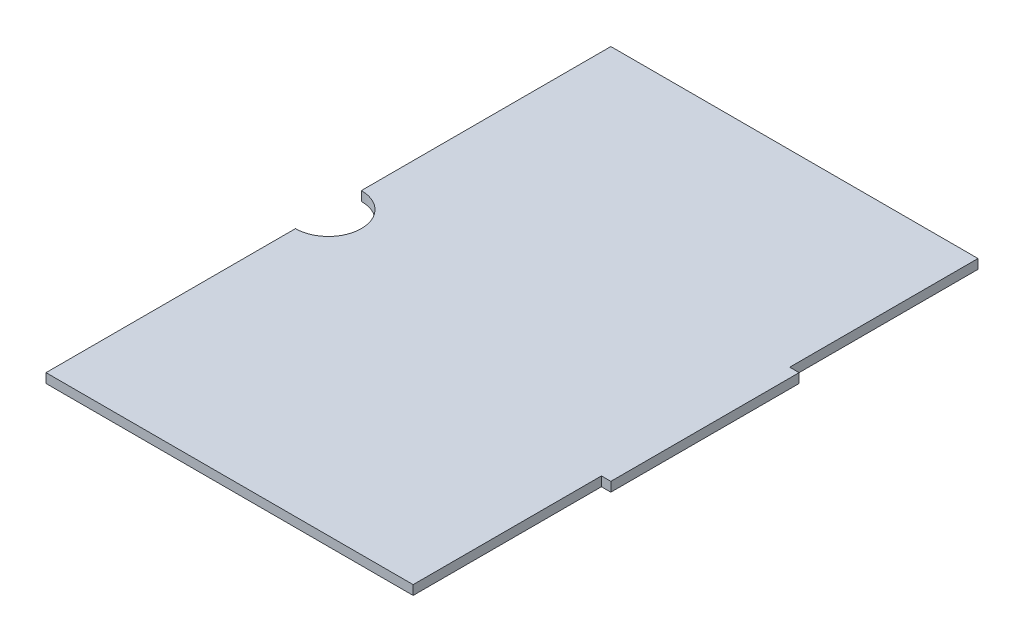
ISO-10303-21;
HEADER;
FILE_DESCRIPTION(('STEP AP214'),'2;1');
FILE_NAME('part.step','',(''),(''),'','','');
FILE_SCHEMA(('AUTOMOTIVE_DESIGN { 1 0 10303 214 1 1 1 1 }'));
ENDSEC;
DATA;
#1=APPLICATION_CONTEXT('core data for automotive mechanical design processes');
#2=APPLICATION_PROTOCOL_DEFINITION('international standard','automotive_design',2000,#1);
#3=PRODUCT_CONTEXT('',#1,'mechanical');
#4=PRODUCT('Part','Part','',(#3));
#5=PRODUCT_RELATED_PRODUCT_CATEGORY('part','',(#4));
#6=PRODUCT_DEFINITION_FORMATION('','',#4);
#7=PRODUCT_DEFINITION_CONTEXT('part definition',#1,'design');
#8=PRODUCT_DEFINITION('design','',#6,#7);
#9=PRODUCT_DEFINITION_SHAPE('','',#8);
#10=(LENGTH_UNIT() NAMED_UNIT(*) SI_UNIT(.MILLI.,.METRE.));
#11=(NAMED_UNIT(*) PLANE_ANGLE_UNIT() SI_UNIT($,.RADIAN.));
#12=(NAMED_UNIT(*) SI_UNIT($,.STERADIAN.) SOLID_ANGLE_UNIT());
#13=UNCERTAINTY_MEASURE_WITH_UNIT(LENGTH_MEASURE(1.E-05),#10,'distance_accuracy_value','');
#14=(GEOMETRIC_REPRESENTATION_CONTEXT(3) GLOBAL_UNCERTAINTY_ASSIGNED_CONTEXT((#13)) GLOBAL_UNIT_ASSIGNED_CONTEXT((#10,
#11,#12)) REPRESENTATION_CONTEXT('',''));
#15=CARTESIAN_POINT('',(0.,0.,0.));
#16=DIRECTION('',(0.,0.,1.));
#17=DIRECTION('',(1.,0.,0.));
#18=AXIS2_PLACEMENT_3D('',#15,#16,#17);
#19=CARTESIAN_POINT('',(-60.,3.,-90.));
#20=DIRECTION('',(1.,0.,0.));
#21=DIRECTION('',(0.,0.,-1.));
#22=AXIS2_PLACEMENT_3D('',#19,#20,#21);
#23=PLANE('',#22);
#24=DIRECTION('',(0.,0.,1.));
#25=VECTOR('',#24,1.);
#26=CARTESIAN_POINT('',(-60.,0.,-90.));
#27=LINE('',#26,#25);
#28=CARTESIAN_POINT('',(-60.,0.,-90.));
#29=VERTEX_POINT('',#28);
#30=CARTESIAN_POINT('',(-60.,0.,-10.5));
#31=VERTEX_POINT('',#30);
#32=EDGE_CURVE('E142',#29,#31,#27,.T.);
#33=ORIENTED_EDGE('',*,*,#32,.T.);
#34=DIRECTION('',(0.,-1.,0.));
#35=VECTOR('',#34,1.);
#36=CARTESIAN_POINT('',(-60.,3.,-10.5));
#37=LINE('',#36,#35);
#38=CARTESIAN_POINT('',(-60.,3.,-10.5));
#39=VERTEX_POINT('',#38);
#40=EDGE_CURVE('E11',#39,#31,#37,.T.);
#41=ORIENTED_EDGE('',*,*,#40,.F.);
#42=DIRECTION('',(0.,0.,1.));
#43=VECTOR('',#42,1.);
#44=CARTESIAN_POINT('',(-60.,3.,-90.));
#45=LINE('',#44,#43);
#46=CARTESIAN_POINT('',(-60.,3.,-90.));
#47=VERTEX_POINT('',#46);
#48=EDGE_CURVE('E160',#47,#39,#45,.T.);
#49=ORIENTED_EDGE('',*,*,#48,.F.);
#50=DIRECTION('',(0.,-1.,0.));
#51=VECTOR('',#50,1.);
#52=CARTESIAN_POINT('',(-60.,3.,-90.));
#53=LINE('',#52,#51);
#54=EDGE_CURVE('E138',#47,#29,#53,.T.);
#55=ORIENTED_EDGE('',*,*,#54,.T.);
#56=EDGE_LOOP('',(#33,#41,#49,#55));
#57=FACE_BOUND('',#56,.T.);
#58=ADVANCED_FACE('F34',(#57),#23,.F.);
#59=CARTESIAN_POINT('',(-60.,3.,0.));
#60=DIRECTION('',(0.,-1.,0.));
#61=DIRECTION('',(0.,0.,-1.));
#62=AXIS2_PLACEMENT_3D('',#59,#60,#61);
#63=CYLINDRICAL_SURFACE('',#62,10.5);
#64=CARTESIAN_POINT('',(-60.,0.,0.));
#65=DIRECTION('',(0.,-1.,0.));
#66=DIRECTION('',(0.,0.,1.));
#67=AXIS2_PLACEMENT_3D('',#64,#65,#66);
#68=CIRCLE('',#67,10.5);
#69=CARTESIAN_POINT('',(-60.,0.,10.5));
#70=VERTEX_POINT('',#69);
#71=EDGE_CURVE('E145',#31,#70,#68,.T.);
#72=ORIENTED_EDGE('',*,*,#71,.T.);
#73=DIRECTION('',(0.,-1.,0.));
#74=VECTOR('',#73,1.);
#75=CARTESIAN_POINT('',(-60.,3.,10.5));
#76=LINE('',#75,#74);
#77=CARTESIAN_POINT('',(-60.,3.,10.5));
#78=VERTEX_POINT('',#77);
#79=EDGE_CURVE('E42',#78,#70,#76,.T.);
#80=ORIENTED_EDGE('',*,*,#79,.F.);
#81=CARTESIAN_POINT('',(-60.,3.,0.));
#82=DIRECTION('',(0.,-1.,0.));
#83=DIRECTION('',(0.,0.,1.));
#84=AXIS2_PLACEMENT_3D('',#81,#82,#83);
#85=CIRCLE('',#84,10.5);
#86=EDGE_CURVE('E99',#39,#78,#85,.T.);
#87=ORIENTED_EDGE('',*,*,#86,.F.);
#88=ORIENTED_EDGE('',*,*,#40,.T.);
#89=EDGE_LOOP('',(#72,#80,#87,#88));
#90=FACE_BOUND('',#89,.T.);
#91=ADVANCED_FACE('F209',(#90),#63,.F.);
#92=CARTESIAN_POINT('',(-60.,3.,10.5));
#93=DIRECTION('',(1.,0.,0.));
#94=DIRECTION('',(0.,0.,-1.));
#95=AXIS2_PLACEMENT_3D('',#92,#93,#94);
#96=PLANE('',#95);
#97=DIRECTION('',(0.,0.,1.));
#98=VECTOR('',#97,1.);
#99=CARTESIAN_POINT('',(-60.,0.,10.5));
#100=LINE('',#99,#98);
#101=CARTESIAN_POINT('',(-60.,0.,90.));
#102=VERTEX_POINT('',#101);
#103=EDGE_CURVE('E147',#70,#102,#100,.T.);
#104=ORIENTED_EDGE('',*,*,#103,.T.);
#105=DIRECTION('',(0.,-1.,0.));
#106=VECTOR('',#105,1.);
#107=CARTESIAN_POINT('',(-60.,3.,90.));
#108=LINE('',#107,#106);
#109=CARTESIAN_POINT('',(-60.,3.,90.));
#110=VERTEX_POINT('',#109);
#111=EDGE_CURVE('E173',#110,#102,#108,.T.);
#112=ORIENTED_EDGE('',*,*,#111,.F.);
#113=DIRECTION('',(0.,0.,1.));
#114=VECTOR('',#113,1.);
#115=CARTESIAN_POINT('',(-60.,3.,10.5));
#116=LINE('',#115,#114);
#117=EDGE_CURVE('E181',#78,#110,#116,.T.);
#118=ORIENTED_EDGE('',*,*,#117,.F.);
#119=ORIENTED_EDGE('',*,*,#79,.T.);
#120=EDGE_LOOP('',(#104,#112,#118,#119));
#121=FACE_BOUND('',#120,.T.);
#122=ADVANCED_FACE('F179',(#121),#96,.F.);
#123=CARTESIAN_POINT('',(-60.,3.,90.));
#124=DIRECTION('',(0.,0.,-1.));
#125=DIRECTION('',(-1.,0.,0.));
#126=AXIS2_PLACEMENT_3D('',#123,#124,#125);
#127=PLANE('',#126);
#128=DIRECTION('',(1.,0.,0.));
#129=VECTOR('',#128,1.);
#130=CARTESIAN_POINT('',(-60.,0.,90.));
#131=LINE('',#130,#129);
#132=CARTESIAN_POINT('',(57.,0.,90.));
#133=VERTEX_POINT('',#132);
#134=EDGE_CURVE('E149',#102,#133,#131,.T.);
#135=ORIENTED_EDGE('',*,*,#134,.T.);
#136=DIRECTION('',(0.,-1.,0.));
#137=VECTOR('',#136,1.);
#138=CARTESIAN_POINT('',(57.,3.,90.));
#139=LINE('',#138,#137);
#140=CARTESIAN_POINT('',(57.,3.,90.));
#141=VERTEX_POINT('',#140);
#142=EDGE_CURVE('E170',#141,#133,#139,.T.);
#143=ORIENTED_EDGE('',*,*,#142,.F.);
#144=DIRECTION('',(1.,0.,0.));
#145=VECTOR('',#144,1.);
#146=CARTESIAN_POINT('',(-60.,3.,90.));
#147=LINE('',#146,#145);
#148=EDGE_CURVE('E199',#110,#141,#147,.T.);
#149=ORIENTED_EDGE('',*,*,#148,.F.);
#150=ORIENTED_EDGE('',*,*,#111,.T.);
#151=EDGE_LOOP('',(#135,#143,#149,#150));
#152=FACE_BOUND('',#151,.T.);
#153=ADVANCED_FACE('F190',(#152),#127,.F.);
#154=CARTESIAN_POINT('',(57.,3.,30.));
#155=DIRECTION('',(-1.,0.,0.));
#156=DIRECTION('',(0.,0.,1.));
#157=AXIS2_PLACEMENT_3D('',#154,#155,#156);
#158=PLANE('',#157);
#159=DIRECTION('',(0.,0.,-1.));
#160=VECTOR('',#159,1.);
#161=CARTESIAN_POINT('',(57.,0.,30.));
#162=LINE('',#161,#160);
#163=CARTESIAN_POINT('',(57.,0.,30.));
#164=VERTEX_POINT('',#163);
#165=EDGE_CURVE('E151',#133,#164,#162,.T.);
#166=ORIENTED_EDGE('',*,*,#165,.T.);
#167=DIRECTION('',(0.,-1.,0.));
#168=VECTOR('',#167,1.);
#169=CARTESIAN_POINT('',(57.,3.,30.));
#170=LINE('',#169,#168);
#171=CARTESIAN_POINT('',(57.,3.,30.));
#172=VERTEX_POINT('',#171);
#173=EDGE_CURVE('E167',#172,#164,#170,.T.);
#174=ORIENTED_EDGE('',*,*,#173,.F.);
#175=DIRECTION('',(0.,0.,-1.));
#176=VECTOR('',#175,1.);
#177=CARTESIAN_POINT('',(57.,3.,30.));
#178=LINE('',#177,#176);
#179=EDGE_CURVE('E196',#141,#172,#178,.T.);
#180=ORIENTED_EDGE('',*,*,#179,.F.);
#181=ORIENTED_EDGE('',*,*,#142,.T.);
#182=EDGE_LOOP('',(#166,#174,#180,#181));
#183=FACE_BOUND('',#182,.T.);
#184=ADVANCED_FACE('F194',(#183),#158,.F.);
#185=CARTESIAN_POINT('',(57.,3.,30.));
#186=DIRECTION('',(0.,0.,-1.));
#187=DIRECTION('',(-1.,0.,0.));
#188=AXIS2_PLACEMENT_3D('',#185,#186,#187);
#189=PLANE('',#188);
#190=DIRECTION('',(1.,0.,0.));
#191=VECTOR('',#190,1.);
#192=CARTESIAN_POINT('',(57.,0.,30.));
#193=LINE('',#192,#191);
#194=CARTESIAN_POINT('',(60.,0.,30.));
#195=VERTEX_POINT('',#194);
#196=EDGE_CURVE('E153',#164,#195,#193,.T.);
#197=ORIENTED_EDGE('',*,*,#196,.T.);
#198=DIRECTION('',(0.,-1.,0.));
#199=VECTOR('',#198,1.);
#200=CARTESIAN_POINT('',(60.,3.,30.));
#201=LINE('',#200,#199);
#202=CARTESIAN_POINT('',(60.,3.,30.));
#203=VERTEX_POINT('',#202);
#204=EDGE_CURVE('E164',#203,#195,#201,.T.);
#205=ORIENTED_EDGE('',*,*,#204,.F.);
#206=DIRECTION('',(1.,0.,0.));
#207=VECTOR('',#206,1.);
#208=CARTESIAN_POINT('',(57.,3.,30.));
#209=LINE('',#208,#207);
#210=EDGE_CURVE('E198',#172,#203,#209,.T.);
#211=ORIENTED_EDGE('',*,*,#210,.F.);
#212=ORIENTED_EDGE('',*,*,#173,.T.);
#213=EDGE_LOOP('',(#197,#205,#211,#212));
#214=FACE_BOUND('',#213,.T.);
#215=ADVANCED_FACE('F221',(#214),#189,.F.);
#216=CARTESIAN_POINT('',(60.,3.,-30.));
#217=DIRECTION('',(-1.,0.,0.));
#218=DIRECTION('',(0.,0.,1.));
#219=AXIS2_PLACEMENT_3D('',#216,#217,#218);
#220=PLANE('',#219);
#221=DIRECTION('',(0.,0.,-1.));
#222=VECTOR('',#221,1.);
#223=CARTESIAN_POINT('',(60.,0.,-30.));
#224=LINE('',#223,#222);
#225=CARTESIAN_POINT('',(60.,0.,-30.));
#226=VERTEX_POINT('',#225);
#227=EDGE_CURVE('E155',#195,#226,#224,.T.);
#228=ORIENTED_EDGE('',*,*,#227,.T.);
#229=DIRECTION('',(0.,-1.,0.));
#230=VECTOR('',#229,1.);
#231=CARTESIAN_POINT('',(60.,3.,-30.));
#232=LINE('',#231,#230);
#233=CARTESIAN_POINT('',(60.,3.,-30.));
#234=VERTEX_POINT('',#233);
#235=EDGE_CURVE('E133',#234,#226,#232,.T.);
#236=ORIENTED_EDGE('',*,*,#235,.F.);
#237=DIRECTION('',(0.,0.,-1.));
#238=VECTOR('',#237,1.);
#239=CARTESIAN_POINT('',(60.,3.,-30.));
#240=LINE('',#239,#238);
#241=EDGE_CURVE('E124',#203,#234,#240,.T.);
#242=ORIENTED_EDGE('',*,*,#241,.F.);
#243=ORIENTED_EDGE('',*,*,#204,.T.);
#244=EDGE_LOOP('',(#228,#236,#242,#243));
#245=FACE_BOUND('',#244,.T.);
#246=ADVANCED_FACE('F224',(#245),#220,.F.);
#247=CARTESIAN_POINT('',(57.,3.,-30.));
#248=DIRECTION('',(0.,0.,1.));
#249=DIRECTION('',(1.,0.,0.));
#250=AXIS2_PLACEMENT_3D('',#247,#248,#249);
#251=PLANE('',#250);
#252=DIRECTION('',(-1.,0.,0.));
#253=VECTOR('',#252,1.);
#254=CARTESIAN_POINT('',(57.,0.,-30.));
#255=LINE('',#254,#253);
#256=CARTESIAN_POINT('',(57.,0.,-30.));
#257=VERTEX_POINT('',#256);
#258=EDGE_CURVE('E132',#226,#257,#255,.T.);
#259=ORIENTED_EDGE('',*,*,#258,.T.);
#260=DIRECTION('',(0.,-1.,0.));
#261=VECTOR('',#260,1.);
#262=CARTESIAN_POINT('',(57.,3.,-30.));
#263=LINE('',#262,#261);
#264=CARTESIAN_POINT('',(57.,3.,-30.));
#265=VERTEX_POINT('',#264);
#266=EDGE_CURVE('E129',#265,#257,#263,.T.);
#267=ORIENTED_EDGE('',*,*,#266,.F.);
#268=DIRECTION('',(-1.,0.,0.));
#269=VECTOR('',#268,1.);
#270=CARTESIAN_POINT('',(57.,3.,-30.));
#271=LINE('',#270,#269);
#272=EDGE_CURVE('E118',#234,#265,#271,.T.);
#273=ORIENTED_EDGE('',*,*,#272,.F.);
#274=ORIENTED_EDGE('',*,*,#235,.T.);
#275=EDGE_LOOP('',(#259,#267,#273,#274));
#276=FACE_BOUND('',#275,.T.);
#277=ADVANCED_FACE('F130',(#276),#251,.F.);
#278=CARTESIAN_POINT('',(57.,3.,-90.));
#279=DIRECTION('',(-1.,0.,0.));
#280=DIRECTION('',(0.,0.,1.));
#281=AXIS2_PLACEMENT_3D('',#278,#279,#280);
#282=PLANE('',#281);
#283=DIRECTION('',(0.,0.,-1.));
#284=VECTOR('',#283,1.);
#285=CARTESIAN_POINT('',(57.,0.,-90.));
#286=LINE('',#285,#284);
#287=CARTESIAN_POINT('',(57.,0.,-90.));
#288=VERTEX_POINT('',#287);
#289=EDGE_CURVE('E85',#257,#288,#286,.T.);
#290=ORIENTED_EDGE('',*,*,#289,.T.);
#291=DIRECTION('',(0.,-1.,0.));
#292=VECTOR('',#291,1.);
#293=CARTESIAN_POINT('',(57.,3.,-90.));
#294=LINE('',#293,#292);
#295=CARTESIAN_POINT('',(57.,3.,-90.));
#296=VERTEX_POINT('',#295);
#297=EDGE_CURVE('E134',#296,#288,#294,.T.);
#298=ORIENTED_EDGE('',*,*,#297,.F.);
#299=DIRECTION('',(0.,0.,-1.));
#300=VECTOR('',#299,1.);
#301=CARTESIAN_POINT('',(57.,3.,-90.));
#302=LINE('',#301,#300);
#303=EDGE_CURVE('E122',#265,#296,#302,.T.);
#304=ORIENTED_EDGE('',*,*,#303,.F.);
#305=ORIENTED_EDGE('',*,*,#266,.T.);
#306=EDGE_LOOP('',(#290,#298,#304,#305));
#307=FACE_BOUND('',#306,.T.);
#308=ADVANCED_FACE('F136',(#307),#282,.F.);
#309=CARTESIAN_POINT('',(-60.,3.,-90.));
#310=DIRECTION('',(0.,0.,1.));
#311=DIRECTION('',(1.,0.,0.));
#312=AXIS2_PLACEMENT_3D('',#309,#310,#311);
#313=PLANE('',#312);
#314=DIRECTION('',(-1.,0.,0.));
#315=VECTOR('',#314,1.);
#316=CARTESIAN_POINT('',(-60.,0.,-90.));
#317=LINE('',#316,#315);
#318=EDGE_CURVE('E91',#288,#29,#317,.T.);
#319=ORIENTED_EDGE('',*,*,#318,.T.);
#320=ORIENTED_EDGE('',*,*,#54,.F.);
#321=DIRECTION('',(-1.,0.,0.));
#322=VECTOR('',#321,1.);
#323=CARTESIAN_POINT('',(-60.,3.,-90.));
#324=LINE('',#323,#322);
#325=EDGE_CURVE('E50',#296,#47,#324,.T.);
#326=ORIENTED_EDGE('',*,*,#325,.F.);
#327=ORIENTED_EDGE('',*,*,#297,.T.);
#328=EDGE_LOOP('',(#319,#320,#326,#327));
#329=FACE_BOUND('',#328,.T.);
#330=ADVANCED_FACE('F233',(#329),#313,.F.);
#331=CARTESIAN_POINT('',(-60.,3.,0.));
#332=DIRECTION('',(0.,1.,0.));
#333=DIRECTION('',(0.,0.,1.));
#334=AXIS2_PLACEMENT_3D('',#331,#332,#333);
#335=PLANE('',#334);
#336=ORIENTED_EDGE('',*,*,#48,.T.);
#337=ORIENTED_EDGE('',*,*,#86,.T.);
#338=ORIENTED_EDGE('',*,*,#117,.T.);
#339=ORIENTED_EDGE('',*,*,#148,.T.);
#340=ORIENTED_EDGE('',*,*,#179,.T.);
#341=ORIENTED_EDGE('',*,*,#210,.T.);
#342=ORIENTED_EDGE('',*,*,#241,.T.);
#343=ORIENTED_EDGE('',*,*,#272,.T.);
#344=ORIENTED_EDGE('',*,*,#303,.T.);
#345=ORIENTED_EDGE('',*,*,#325,.T.);
#346=EDGE_LOOP('',(#336,#337,#338,#339,#340,#341,#342,#343,#344,#345));
#347=FACE_BOUND('',#346,.T.);
#348=ADVANCED_FACE('F120',(#347),#335,.T.);
#349=CARTESIAN_POINT('',(-60.,0.,0.));
#350=DIRECTION('',(0.,1.,0.));
#351=DIRECTION('',(0.,0.,1.));
#352=AXIS2_PLACEMENT_3D('',#349,#350,#351);
#353=PLANE('',#352);
#354=ORIENTED_EDGE('',*,*,#32,.F.);
#355=ORIENTED_EDGE('',*,*,#318,.F.);
#356=ORIENTED_EDGE('',*,*,#289,.F.);
#357=ORIENTED_EDGE('',*,*,#258,.F.);
#358=ORIENTED_EDGE('',*,*,#227,.F.);
#359=ORIENTED_EDGE('',*,*,#196,.F.);
#360=ORIENTED_EDGE('',*,*,#165,.F.);
#361=ORIENTED_EDGE('',*,*,#134,.F.);
#362=ORIENTED_EDGE('',*,*,#103,.F.);
#363=ORIENTED_EDGE('',*,*,#71,.F.);
#364=EDGE_LOOP('',(#354,#355,#356,#357,#358,#359,#360,#361,#362,#363));
#365=FACE_BOUND('',#364,.T.);
#366=ADVANCED_FACE('F185',(#365),#353,.F.);
#367=CLOSED_SHELL('',(#58,#91,#122,#153,#184,#215,#246,#277,#308,#330,#348,#366));
#368=MANIFOLD_SOLID_BREP('B2',#367);
#369=ADVANCED_BREP_SHAPE_REPRESENTATION('',(#18,#368),#14);
#370=SHAPE_DEFINITION_REPRESENTATION(#9,#369);
ENDSEC;
END-ISO-10303-21;
